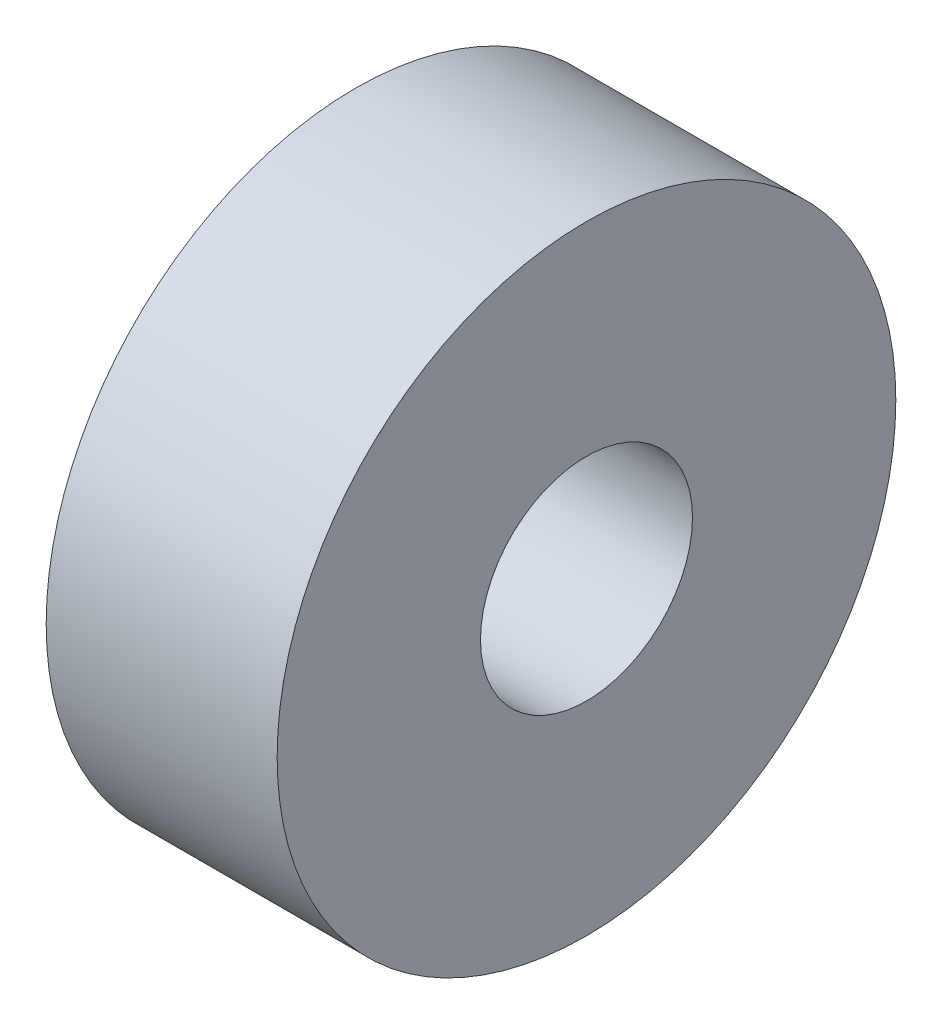
ISO-10303-21;
HEADER;
FILE_DESCRIPTION(('STEP AP214'),'2;1');
FILE_NAME('part.step','',(''),(''),'','','');
FILE_SCHEMA(('AUTOMOTIVE_DESIGN { 1 0 10303 214 1 1 1 1 }'));
ENDSEC;
DATA;
#1=APPLICATION_CONTEXT('core data for automotive mechanical design processes');
#2=APPLICATION_PROTOCOL_DEFINITION('international standard','automotive_design',2000,#1);
#3=PRODUCT_CONTEXT('',#1,'mechanical');
#4=PRODUCT('Part','Part','',(#3));
#5=PRODUCT_RELATED_PRODUCT_CATEGORY('part','',(#4));
#6=PRODUCT_DEFINITION_FORMATION('','',#4);
#7=PRODUCT_DEFINITION_CONTEXT('part definition',#1,'design');
#8=PRODUCT_DEFINITION('design','',#6,#7);
#9=PRODUCT_DEFINITION_SHAPE('','',#8);
#10=(LENGTH_UNIT() NAMED_UNIT(*) SI_UNIT(.MILLI.,.METRE.));
#11=(NAMED_UNIT(*) PLANE_ANGLE_UNIT() SI_UNIT($,.RADIAN.));
#12=(NAMED_UNIT(*) SI_UNIT($,.STERADIAN.) SOLID_ANGLE_UNIT());
#13=UNCERTAINTY_MEASURE_WITH_UNIT(LENGTH_MEASURE(1.E-05),#10,'distance_accuracy_value','');
#14=(GEOMETRIC_REPRESENTATION_CONTEXT(3) GLOBAL_UNCERTAINTY_ASSIGNED_CONTEXT((#13)) GLOBAL_UNIT_ASSIGNED_CONTEXT((#10,
#11,#12)) REPRESENTATION_CONTEXT('',''));
#15=CARTESIAN_POINT('',(0.,0.,0.));
#16=DIRECTION('',(0.,0.,1.));
#17=DIRECTION('',(1.,0.,0.));
#18=AXIS2_PLACEMENT_3D('',#15,#16,#17);
#19=CARTESIAN_POINT('',(7.112,0.,0.));
#20=DIRECTION('',(1.,0.,0.));
#21=DIRECTION('',(0.,0.,-1.));
#22=AXIS2_PLACEMENT_3D('',#19,#20,#21);
#23=PLANE('',#22);
#24=CARTESIAN_POINT('',(7.112,0.,0.));
#25=DIRECTION('',(1.,0.,0.));
#26=DIRECTION('',(0.,0.,-1.));
#27=AXIS2_PLACEMENT_3D('',#24,#25,#26);
#28=CIRCLE('',#27,9.525);
#29=CARTESIAN_POINT('',(7.112,0.,-9.525));
#30=VERTEX_POINT('',#29);
#31=EDGE_CURVE('E10',#30,#30,#28,.T.);
#32=ORIENTED_EDGE('',*,*,#31,.T.);
#33=EDGE_LOOP('',(#32));
#34=FACE_BOUND('',#33,.T.);
#35=CARTESIAN_POINT('',(7.112,0.,0.));
#36=DIRECTION('',(1.,0.,0.));
#37=DIRECTION('',(0.,0.,-1.));
#38=AXIS2_PLACEMENT_3D('',#35,#36,#37);
#39=CIRCLE('',#38,3.2639);
#40=CARTESIAN_POINT('',(7.112,0.,-3.2639));
#41=VERTEX_POINT('',#40);
#42=EDGE_CURVE('E46',#41,#41,#39,.T.);
#43=ORIENTED_EDGE('',*,*,#42,.F.);
#44=EDGE_LOOP('',(#43));
#45=FACE_BOUND('',#44,.T.);
#46=ADVANCED_FACE('F35',(#34,#45),#23,.T.);
#47=CARTESIAN_POINT('',(0.,0.,0.));
#48=DIRECTION('',(1.,0.,0.));
#49=DIRECTION('',(0.,0.,-1.));
#50=AXIS2_PLACEMENT_3D('',#47,#48,#49);
#51=PLANE('',#50);
#52=CARTESIAN_POINT('',(0.,0.,0.));
#53=DIRECTION('',(1.,0.,0.));
#54=DIRECTION('',(0.,0.,-1.));
#55=AXIS2_PLACEMENT_3D('',#52,#53,#54);
#56=CIRCLE('',#55,9.525);
#57=CARTESIAN_POINT('',(0.,0.,-9.525));
#58=VERTEX_POINT('',#57);
#59=EDGE_CURVE('E39',#58,#58,#56,.T.);
#60=ORIENTED_EDGE('',*,*,#59,.F.);
#61=EDGE_LOOP('',(#60));
#62=FACE_BOUND('',#61,.T.);
#63=CARTESIAN_POINT('',(0.,0.,0.));
#64=DIRECTION('',(1.,0.,0.));
#65=DIRECTION('',(0.,0.,-1.));
#66=AXIS2_PLACEMENT_3D('',#63,#64,#65);
#67=CIRCLE('',#66,3.2639);
#68=CARTESIAN_POINT('',(0.,0.,-3.2639));
#69=VERTEX_POINT('',#68);
#70=EDGE_CURVE('E48',#69,#69,#67,.T.);
#71=ORIENTED_EDGE('',*,*,#70,.T.);
#72=EDGE_LOOP('',(#71));
#73=FACE_BOUND('',#72,.T.);
#74=ADVANCED_FACE('F58',(#62,#73),#51,.F.);
#75=CARTESIAN_POINT('',(7.112,0.,0.));
#76=DIRECTION('',(-1.,0.,0.));
#77=DIRECTION('',(0.,0.,1.));
#78=AXIS2_PLACEMENT_3D('',#75,#76,#77);
#79=CYLINDRICAL_SURFACE('',#78,9.525);
#80=ORIENTED_EDGE('',*,*,#31,.F.);
#81=EDGE_LOOP('',(#80));
#82=FACE_BOUND('',#81,.T.);
#83=ORIENTED_EDGE('',*,*,#59,.T.);
#84=EDGE_LOOP('',(#83));
#85=FACE_BOUND('',#84,.T.);
#86=ADVANCED_FACE('F37',(#82,#85),#79,.T.);
#87=CARTESIAN_POINT('',(7.112,0.,0.));
#88=DIRECTION('',(-1.,0.,0.));
#89=DIRECTION('',(0.,0.,1.));
#90=AXIS2_PLACEMENT_3D('',#87,#88,#89);
#91=CYLINDRICAL_SURFACE('',#90,3.2639);
#92=ORIENTED_EDGE('',*,*,#42,.T.);
#93=EDGE_LOOP('',(#92));
#94=FACE_BOUND('',#93,.T.);
#95=ORIENTED_EDGE('',*,*,#70,.F.);
#96=EDGE_LOOP('',(#95));
#97=FACE_BOUND('',#96,.T.);
#98=ADVANCED_FACE('F54',(#94,#97),#91,.F.);
#99=CLOSED_SHELL('',(#46,#74,#86,#98));
#100=MANIFOLD_SOLID_BREP('B2',#99);
#101=ADVANCED_BREP_SHAPE_REPRESENTATION('',(#18,#100),#14);
#102=SHAPE_DEFINITION_REPRESENTATION(#9,#101);
ENDSEC;
END-ISO-10303-21;
